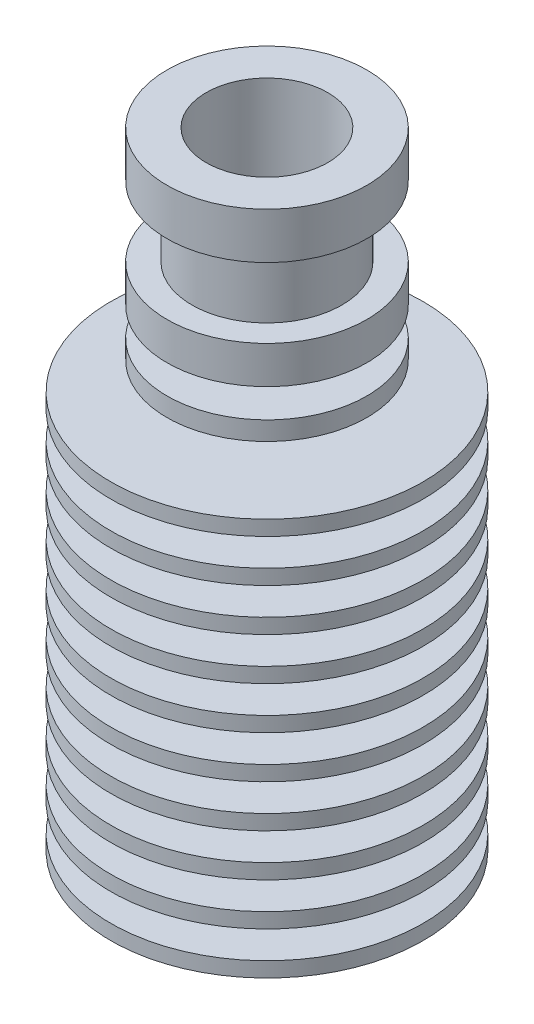
ISO-10303-21;
HEADER;
FILE_DESCRIPTION(('STEP AP214'),'2;1');
FILE_NAME('part.step','',(''),(''),'','','');
FILE_SCHEMA(('AUTOMOTIVE_DESIGN { 1 0 10303 214 1 1 1 1 }'));
ENDSEC;
DATA;
#1=APPLICATION_CONTEXT('core data for automotive mechanical design processes');
#2=APPLICATION_PROTOCOL_DEFINITION('international standard','automotive_design',2000,#1);
#3=PRODUCT_CONTEXT('',#1,'mechanical');
#4=PRODUCT('Part','Part','',(#3));
#5=PRODUCT_RELATED_PRODUCT_CATEGORY('part','',(#4));
#6=PRODUCT_DEFINITION_FORMATION('','',#4);
#7=PRODUCT_DEFINITION_CONTEXT('part definition',#1,'design');
#8=PRODUCT_DEFINITION('design','',#6,#7);
#9=PRODUCT_DEFINITION_SHAPE('','',#8);
#10=(LENGTH_UNIT() NAMED_UNIT(*) SI_UNIT(.MILLI.,.METRE.));
#11=(NAMED_UNIT(*) PLANE_ANGLE_UNIT() SI_UNIT($,.RADIAN.));
#12=(NAMED_UNIT(*) SI_UNIT($,.STERADIAN.) SOLID_ANGLE_UNIT());
#13=UNCERTAINTY_MEASURE_WITH_UNIT(LENGTH_MEASURE(1.E-05),#10,'distance_accuracy_value','');
#14=(GEOMETRIC_REPRESENTATION_CONTEXT(3) GLOBAL_UNCERTAINTY_ASSIGNED_CONTEXT((#13)) GLOBAL_UNIT_ASSIGNED_CONTEXT((#10,
#11,#12)) REPRESENTATION_CONTEXT('',''));
#15=CARTESIAN_POINT('',(0.,0.,0.));
#16=DIRECTION('',(0.,0.,1.));
#17=DIRECTION('',(1.,0.,0.));
#18=AXIS2_PLACEMENT_3D('',#15,#16,#17);
#19=CARTESIAN_POINT('',(0.,-25.05,0.));
#20=DIRECTION('',(0.,-1.,0.));
#21=DIRECTION('',(0.,0.,-1.));
#22=AXIS2_PLACEMENT_3D('',#19,#20,#21);
#23=CYLINDRICAL_SURFACE('',#22,3.);
#24=CARTESIAN_POINT('',(0.,-25.05,0.));
#25=DIRECTION('',(0.,-1.,0.));
#26=DIRECTION('',(0.,0.,-1.));
#27=AXIS2_PLACEMENT_3D('',#24,#25,#26);
#28=CIRCLE('',#27,3.);
#29=CARTESIAN_POINT('',(0.,-25.05,-3.));
#30=VERTEX_POINT('',#29);
#31=EDGE_CURVE('E208',#30,#30,#28,.T.);
#32=ORIENTED_EDGE('',*,*,#31,.T.);
#33=EDGE_LOOP('',(#32));
#34=FACE_BOUND('',#33,.T.);
#35=CARTESIAN_POINT('',(0.,-7.05,0.));
#36=DIRECTION('',(0.,-1.,0.));
#37=DIRECTION('',(0.,0.,-1.));
#38=AXIS2_PLACEMENT_3D('',#35,#36,#37);
#39=CIRCLE('',#38,3.);
#40=CARTESIAN_POINT('',(0.,-7.05,-3.));
#41=VERTEX_POINT('',#40);
#42=EDGE_CURVE('E10',#41,#41,#39,.T.);
#43=ORIENTED_EDGE('',*,*,#42,.F.);
#44=EDGE_LOOP('',(#43));
#45=FACE_BOUND('',#44,.T.);
#46=ADVANCED_FACE('F30',(#34,#45),#23,.F.);
#47=CARTESIAN_POINT('',(0.,-5.89529946162076,0.));
#48=DIRECTION('',(0.,-1.,0.));
#49=DIRECTION('',(0.,0.,-1.));
#50=AXIS2_PLACEMENT_3D('',#47,#48,#49);
#51=CONICAL_SURFACE('',#50,1.,1.0471975511966);
#52=ORIENTED_EDGE('',*,*,#42,.T.);
#53=EDGE_LOOP('',(#52));
#54=FACE_BOUND('',#53,.T.);
#55=CARTESIAN_POINT('',(0.,-5.89529946162076,0.));
#56=DIRECTION('',(0.,-1.,0.));
#57=DIRECTION('',(0.,0.,-1.));
#58=AXIS2_PLACEMENT_3D('',#55,#56,#57);
#59=CIRCLE('',#58,1.);
#60=CARTESIAN_POINT('',(0.,-5.89529946162076,-1.));
#61=VERTEX_POINT('',#60);
#62=EDGE_CURVE('E36',#61,#61,#59,.T.);
#63=ORIENTED_EDGE('',*,*,#62,.F.);
#64=EDGE_LOOP('',(#63));
#65=FACE_BOUND('',#64,.T.);
#66=ADVANCED_FACE('F226',(#54,#65),#51,.F.);
#67=CARTESIAN_POINT('',(0.,-25.05,0.));
#68=DIRECTION('',(0.,-1.,0.));
#69=DIRECTION('',(0.,0.,-1.));
#70=AXIS2_PLACEMENT_3D('',#67,#68,#69);
#71=CYLINDRICAL_SURFACE('',#70,1.);
#72=ORIENTED_EDGE('',*,*,#62,.T.);
#73=EDGE_LOOP('',(#72));
#74=FACE_BOUND('',#73,.T.);
#75=CARTESIAN_POINT('',(0.,5.51188301285237,0.));
#76=DIRECTION('',(0.,-1.,0.));
#77=DIRECTION('',(0.,0.,-1.));
#78=AXIS2_PLACEMENT_3D('',#75,#76,#77);
#79=CIRCLE('',#78,1.);
#80=CARTESIAN_POINT('',(0.,5.51188301285237,-1.));
#81=VERTEX_POINT('',#80);
#82=EDGE_CURVE('E40',#81,#81,#79,.T.);
#83=ORIENTED_EDGE('',*,*,#82,.F.);
#84=EDGE_LOOP('',(#83));
#85=FACE_BOUND('',#84,.T.);
#86=ADVANCED_FACE('F230',(#74,#85),#71,.F.);
#87=CARTESIAN_POINT('',(0.,6.08923328204199,0.));
#88=DIRECTION('',(0.,1.,0.));
#89=DIRECTION('',(0.,0.,1.));
#90=AXIS2_PLACEMENT_3D('',#87,#88,#89);
#91=CONICAL_SURFACE('',#90,2.,1.0471975511966);
#92=ORIENTED_EDGE('',*,*,#82,.T.);
#93=EDGE_LOOP('',(#92));
#94=FACE_BOUND('',#93,.T.);
#95=CARTESIAN_POINT('',(0.,6.08923328204199,0.));
#96=DIRECTION('',(0.,-1.,0.));
#97=DIRECTION('',(0.,0.,-1.));
#98=AXIS2_PLACEMENT_3D('',#95,#96,#97);
#99=CIRCLE('',#98,2.);
#100=CARTESIAN_POINT('',(0.,6.08923328204199,-2.));
#101=VERTEX_POINT('',#100);
#102=EDGE_CURVE('E44',#101,#101,#99,.T.);
#103=ORIENTED_EDGE('',*,*,#102,.F.);
#104=EDGE_LOOP('',(#103));
#105=FACE_BOUND('',#104,.T.);
#106=ADVANCED_FACE('F234',(#94,#105),#91,.F.);
#107=CARTESIAN_POINT('',(0.,-25.05,0.));
#108=DIRECTION('',(0.,-1.,0.));
#109=DIRECTION('',(0.,0.,-1.));
#110=AXIS2_PLACEMENT_3D('',#107,#108,#109);
#111=CYLINDRICAL_SURFACE('',#110,2.);
#112=ORIENTED_EDGE('',*,*,#102,.T.);
#113=EDGE_LOOP('',(#112));
#114=FACE_BOUND('',#113,.T.);
#115=CARTESIAN_POINT('',(0.,10.089233282042,0.));
#116=DIRECTION('',(0.,-1.,0.));
#117=DIRECTION('',(0.,0.,-1.));
#118=AXIS2_PLACEMENT_3D('',#115,#116,#117);
#119=CIRCLE('',#118,2.);
#120=CARTESIAN_POINT('',(0.,10.089233282042,-2.));
#121=VERTEX_POINT('',#120);
#122=EDGE_CURVE('E49',#121,#121,#119,.T.);
#123=ORIENTED_EDGE('',*,*,#122,.F.);
#124=EDGE_LOOP('',(#123));
#125=FACE_BOUND('',#124,.T.);
#126=ADVANCED_FACE('F240',(#114,#125),#111,.F.);
#127=CARTESIAN_POINT('',(0.,15.05,0.));
#128=DIRECTION('',(0.,1.,0.));
#129=DIRECTION('',(0.,0.,1.));
#130=AXIS2_PLACEMENT_3D('',#127,#128,#129);
#131=CONICAL_SURFACE('',#130,4.8641,0.5235987755983);
#132=ORIENTED_EDGE('',*,*,#122,.T.);
#133=EDGE_LOOP('',(#132));
#134=FACE_BOUND('',#133,.T.);
#135=CARTESIAN_POINT('',(0.,15.05,0.));
#136=DIRECTION('',(0.,-1.,0.));
#137=DIRECTION('',(0.,0.,-1.));
#138=AXIS2_PLACEMENT_3D('',#135,#136,#137);
#139=CIRCLE('',#138,4.8641);
#140=CARTESIAN_POINT('',(0.,15.05,-4.8641));
#141=VERTEX_POINT('',#140);
#142=EDGE_CURVE('E52',#141,#141,#139,.T.);
#143=ORIENTED_EDGE('',*,*,#142,.F.);
#144=EDGE_LOOP('',(#143));
#145=FACE_BOUND('',#144,.T.);
#146=ADVANCED_FACE('F244',(#134,#145),#131,.F.);
#147=CARTESIAN_POINT('',(0.,-25.05,0.));
#148=DIRECTION('',(0.,-1.,0.));
#149=DIRECTION('',(0.,0.,-1.));
#150=AXIS2_PLACEMENT_3D('',#147,#148,#149);
#151=CYLINDRICAL_SURFACE('',#150,4.8641);
#152=ORIENTED_EDGE('',*,*,#142,.T.);
#153=EDGE_LOOP('',(#152));
#154=FACE_BOUND('',#153,.T.);
#155=CARTESIAN_POINT('',(0.,25.05,0.));
#156=DIRECTION('',(0.,-1.,0.));
#157=DIRECTION('',(0.,0.,-1.));
#158=AXIS2_PLACEMENT_3D('',#155,#156,#157);
#159=CIRCLE('',#158,4.8641);
#160=CARTESIAN_POINT('',(0.,25.05,-4.8641));
#161=VERTEX_POINT('',#160);
#162=EDGE_CURVE('E55',#161,#161,#159,.T.);
#163=ORIENTED_EDGE('',*,*,#162,.F.);
#164=EDGE_LOOP('',(#163));
#165=FACE_BOUND('',#164,.T.);
#166=ADVANCED_FACE('F248',(#154,#165),#151,.F.);
#167=CARTESIAN_POINT('',(4.8641,25.05,0.));
#168=DIRECTION('',(0.,1.,0.));
#169=DIRECTION('',(0.,0.,1.));
#170=AXIS2_PLACEMENT_3D('',#167,#168,#169);
#171=PLANE('',#170);
#172=ORIENTED_EDGE('',*,*,#162,.T.);
#173=EDGE_LOOP('',(#172));
#174=FACE_BOUND('',#173,.T.);
#175=CARTESIAN_POINT('',(0.,25.05,0.));
#176=DIRECTION('',(0.,-1.,0.));
#177=DIRECTION('',(0.,0.,-1.));
#178=AXIS2_PLACEMENT_3D('',#175,#176,#177);
#179=CIRCLE('',#178,8.);
#180=CARTESIAN_POINT('',(0.,25.05,-8.));
#181=VERTEX_POINT('',#180);
#182=EDGE_CURVE('E58',#181,#181,#179,.T.);
#183=ORIENTED_EDGE('',*,*,#182,.F.);
#184=EDGE_LOOP('',(#183));
#185=FACE_BOUND('',#184,.T.);
#186=ADVANCED_FACE('F252',(#174,#185),#171,.T.);
#187=CARTESIAN_POINT('',(0.,-25.05,0.));
#188=DIRECTION('',(0.,-1.,0.));
#189=DIRECTION('',(0.,0.,-1.));
#190=AXIS2_PLACEMENT_3D('',#187,#188,#189);
#191=CYLINDRICAL_SURFACE('',#190,8.);
#192=ORIENTED_EDGE('',*,*,#182,.T.);
#193=EDGE_LOOP('',(#192));
#194=FACE_BOUND('',#193,.T.);
#195=CARTESIAN_POINT('',(0.,21.35,0.));
#196=DIRECTION('',(0.,-1.,0.));
#197=DIRECTION('',(0.,0.,-1.));
#198=AXIS2_PLACEMENT_3D('',#195,#196,#197);
#199=CIRCLE('',#198,8.);
#200=CARTESIAN_POINT('',(0.,21.35,-8.));
#201=VERTEX_POINT('',#200);
#202=EDGE_CURVE('E61',#201,#201,#199,.T.);
#203=ORIENTED_EDGE('',*,*,#202,.F.);
#204=EDGE_LOOP('',(#203));
#205=FACE_BOUND('',#204,.T.);
#206=ADVANCED_FACE('F256',(#194,#205),#191,.T.);
#207=CARTESIAN_POINT('',(6.,21.35,0.));
#208=DIRECTION('',(0.,-1.,0.));
#209=DIRECTION('',(0.,0.,-1.));
#210=AXIS2_PLACEMENT_3D('',#207,#208,#209);
#211=PLANE('',#210);
#212=ORIENTED_EDGE('',*,*,#202,.T.);
#213=EDGE_LOOP('',(#212));
#214=FACE_BOUND('',#213,.T.);
#215=CARTESIAN_POINT('',(0.,21.35,0.));
#216=DIRECTION('',(0.,-1.,0.));
#217=DIRECTION('',(0.,0.,-1.));
#218=AXIS2_PLACEMENT_3D('',#215,#216,#217);
#219=CIRCLE('',#218,6.);
#220=CARTESIAN_POINT('',(0.,21.35,-6.));
#221=VERTEX_POINT('',#220);
#222=EDGE_CURVE('E64',#221,#221,#219,.T.);
#223=ORIENTED_EDGE('',*,*,#222,.F.);
#224=EDGE_LOOP('',(#223));
#225=FACE_BOUND('',#224,.T.);
#226=ADVANCED_FACE('F260',(#214,#225),#211,.T.);
#227=CARTESIAN_POINT('',(0.,-25.05,0.));
#228=DIRECTION('',(0.,-1.,0.));
#229=DIRECTION('',(0.,0.,-1.));
#230=AXIS2_PLACEMENT_3D('',#227,#228,#229);
#231=CYLINDRICAL_SURFACE('',#230,6.);
#232=ORIENTED_EDGE('',*,*,#222,.T.);
#233=EDGE_LOOP('',(#232));
#234=FACE_BOUND('',#233,.T.);
#235=CARTESIAN_POINT('',(0.,15.75,0.));
#236=DIRECTION('',(0.,-1.,0.));
#237=DIRECTION('',(0.,0.,-1.));
#238=AXIS2_PLACEMENT_3D('',#235,#236,#237);
#239=CIRCLE('',#238,6.);
#240=CARTESIAN_POINT('',(0.,15.75,-6.));
#241=VERTEX_POINT('',#240);
#242=EDGE_CURVE('E67',#241,#241,#239,.T.);
#243=ORIENTED_EDGE('',*,*,#242,.F.);
#244=EDGE_LOOP('',(#243));
#245=FACE_BOUND('',#244,.T.);
#246=ADVANCED_FACE('F264',(#234,#245),#231,.T.);
#247=CARTESIAN_POINT('',(8.,15.75,0.));
#248=DIRECTION('',(0.,1.,0.));
#249=DIRECTION('',(0.,0.,1.));
#250=AXIS2_PLACEMENT_3D('',#247,#248,#249);
#251=PLANE('',#250);
#252=ORIENTED_EDGE('',*,*,#242,.T.);
#253=EDGE_LOOP('',(#252));
#254=FACE_BOUND('',#253,.T.);
#255=CARTESIAN_POINT('',(0.,15.75,0.));
#256=DIRECTION('',(0.,-1.,0.));
#257=DIRECTION('',(0.,0.,-1.));
#258=AXIS2_PLACEMENT_3D('',#255,#256,#257);
#259=CIRCLE('',#258,8.);
#260=CARTESIAN_POINT('',(0.,15.75,-8.));
#261=VERTEX_POINT('',#260);
#262=EDGE_CURVE('E70',#261,#261,#259,.T.);
#263=ORIENTED_EDGE('',*,*,#262,.F.);
#264=EDGE_LOOP('',(#263));
#265=FACE_BOUND('',#264,.T.);
#266=ADVANCED_FACE('F268',(#254,#265),#251,.T.);
#267=CARTESIAN_POINT('',(0.,-25.05,0.));
#268=DIRECTION('',(0.,-1.,0.));
#269=DIRECTION('',(0.,0.,-1.));
#270=AXIS2_PLACEMENT_3D('',#267,#268,#269);
#271=CYLINDRICAL_SURFACE('',#270,8.);
#272=ORIENTED_EDGE('',*,*,#262,.T.);
#273=EDGE_LOOP('',(#272));
#274=FACE_BOUND('',#273,.T.);
#275=CARTESIAN_POINT('',(0.,12.75,0.));
#276=DIRECTION('',(0.,-1.,0.));
#277=DIRECTION('',(0.,0.,-1.));
#278=AXIS2_PLACEMENT_3D('',#275,#276,#277);
#279=CIRCLE('',#278,8.);
#280=CARTESIAN_POINT('',(0.,12.75,-8.));
#281=VERTEX_POINT('',#280);
#282=EDGE_CURVE('E73',#281,#281,#279,.T.);
#283=ORIENTED_EDGE('',*,*,#282,.F.);
#284=EDGE_LOOP('',(#283));
#285=FACE_BOUND('',#284,.T.);
#286=ADVANCED_FACE('F272',(#274,#285),#271,.T.);
#287=CARTESIAN_POINT('',(4.5,12.75,0.));
#288=DIRECTION('',(0.,-1.,0.));
#289=DIRECTION('',(0.,0.,-1.));
#290=AXIS2_PLACEMENT_3D('',#287,#288,#289);
#291=PLANE('',#290);
#292=ORIENTED_EDGE('',*,*,#282,.T.);
#293=EDGE_LOOP('',(#292));
#294=FACE_BOUND('',#293,.T.);
#295=CARTESIAN_POINT('',(0.,12.75,0.));
#296=DIRECTION('',(0.,-1.,0.));
#297=DIRECTION('',(0.,0.,-1.));
#298=AXIS2_PLACEMENT_3D('',#295,#296,#297);
#299=CIRCLE('',#298,4.5);
#300=CARTESIAN_POINT('',(0.,12.75,-4.5));
#301=VERTEX_POINT('',#300);
#302=EDGE_CURVE('E76',#301,#301,#299,.T.);
#303=ORIENTED_EDGE('',*,*,#302,.F.);
#304=EDGE_LOOP('',(#303));
#305=FACE_BOUND('',#304,.T.);
#306=ADVANCED_FACE('F276',(#294,#305),#291,.T.);
#307=CARTESIAN_POINT('',(0.,-25.05,0.));
#308=DIRECTION('',(0.,-1.,0.));
#309=DIRECTION('',(0.,0.,-1.));
#310=AXIS2_PLACEMENT_3D('',#307,#308,#309);
#311=CYLINDRICAL_SURFACE('',#310,4.5);
#312=ORIENTED_EDGE('',*,*,#302,.T.);
#313=EDGE_LOOP('',(#312));
#314=FACE_BOUND('',#313,.T.);
#315=CARTESIAN_POINT('',(0.,10.45,0.));
#316=DIRECTION('',(0.,-1.,0.));
#317=DIRECTION('',(0.,0.,-1.));
#318=AXIS2_PLACEMENT_3D('',#315,#316,#317);
#319=CIRCLE('',#318,4.5);
#320=CARTESIAN_POINT('',(0.,10.45,-4.5));
#321=VERTEX_POINT('',#320);
#322=EDGE_CURVE('E79',#321,#321,#319,.T.);
#323=ORIENTED_EDGE('',*,*,#322,.F.);
#324=EDGE_LOOP('',(#323));
#325=FACE_BOUND('',#324,.T.);
#326=ADVANCED_FACE('F280',(#314,#325),#311,.T.);
#327=CARTESIAN_POINT('',(8.,10.45,0.));
#328=DIRECTION('',(0.,1.,0.));
#329=DIRECTION('',(0.,0.,1.));
#330=AXIS2_PLACEMENT_3D('',#327,#328,#329);
#331=PLANE('',#330);
#332=ORIENTED_EDGE('',*,*,#322,.T.);
#333=EDGE_LOOP('',(#332));
#334=FACE_BOUND('',#333,.T.);
#335=CARTESIAN_POINT('',(0.,10.45,0.));
#336=DIRECTION('',(0.,-1.,0.));
#337=DIRECTION('',(0.,0.,-1.));
#338=AXIS2_PLACEMENT_3D('',#335,#336,#337);
#339=CIRCLE('',#338,8.);
#340=CARTESIAN_POINT('',(0.,10.45,-8.));
#341=VERTEX_POINT('',#340);
#342=EDGE_CURVE('E82',#341,#341,#339,.T.);
#343=ORIENTED_EDGE('',*,*,#342,.F.);
#344=EDGE_LOOP('',(#343));
#345=FACE_BOUND('',#344,.T.);
#346=ADVANCED_FACE('F284',(#334,#345),#331,.T.);
#347=CARTESIAN_POINT('',(0.,-25.05,0.));
#348=DIRECTION('',(0.,-1.,0.));
#349=DIRECTION('',(0.,0.,-1.));
#350=AXIS2_PLACEMENT_3D('',#347,#348,#349);
#351=CYLINDRICAL_SURFACE('',#350,8.);
#352=ORIENTED_EDGE('',*,*,#342,.T.);
#353=EDGE_LOOP('',(#352));
#354=FACE_BOUND('',#353,.T.);
#355=CARTESIAN_POINT('',(0.,8.95,0.));
#356=DIRECTION('',(0.,-1.,0.));
#357=DIRECTION('',(0.,0.,-1.));
#358=AXIS2_PLACEMENT_3D('',#355,#356,#357);
#359=CIRCLE('',#358,8.);
#360=CARTESIAN_POINT('',(0.,8.95,-8.));
#361=VERTEX_POINT('',#360);
#362=EDGE_CURVE('E85',#361,#361,#359,.T.);
#363=ORIENTED_EDGE('',*,*,#362,.F.);
#364=EDGE_LOOP('',(#363));
#365=FACE_BOUND('',#364,.T.);
#366=ADVANCED_FACE('F288',(#354,#365),#351,.T.);
#367=CARTESIAN_POINT('',(4.5,8.95,0.));
#368=DIRECTION('',(0.,-1.,0.));
#369=DIRECTION('',(0.,0.,-1.));
#370=AXIS2_PLACEMENT_3D('',#367,#368,#369);
#371=PLANE('',#370);
#372=ORIENTED_EDGE('',*,*,#362,.T.);
#373=EDGE_LOOP('',(#372));
#374=FACE_BOUND('',#373,.T.);
#375=CARTESIAN_POINT('',(0.,8.95,0.));
#376=DIRECTION('',(0.,-1.,0.));
#377=DIRECTION('',(0.,0.,-1.));
#378=AXIS2_PLACEMENT_3D('',#375,#376,#377);
#379=CIRCLE('',#378,4.5);
#380=CARTESIAN_POINT('',(0.,8.95,-4.5));
#381=VERTEX_POINT('',#380);
#382=EDGE_CURVE('E88',#381,#381,#379,.T.);
#383=ORIENTED_EDGE('',*,*,#382,.F.);
#384=EDGE_LOOP('',(#383));
#385=FACE_BOUND('',#384,.T.);
#386=ADVANCED_FACE('F292',(#374,#385),#371,.T.);
#387=CARTESIAN_POINT('',(0.,-25.05,0.));
#388=DIRECTION('',(0.,-1.,0.));
#389=DIRECTION('',(0.,0.,-1.));
#390=AXIS2_PLACEMENT_3D('',#387,#388,#389);
#391=CYLINDRICAL_SURFACE('',#390,4.5);
#392=ORIENTED_EDGE('',*,*,#382,.T.);
#393=EDGE_LOOP('',(#392));
#394=FACE_BOUND('',#393,.T.);
#395=CARTESIAN_POINT('',(0.,6.75,0.));
#396=DIRECTION('',(0.,-1.,0.));
#397=DIRECTION('',(0.,0.,-1.));
#398=AXIS2_PLACEMENT_3D('',#395,#396,#397);
#399=CIRCLE('',#398,4.5);
#400=CARTESIAN_POINT('',(0.,6.75,-4.5));
#401=VERTEX_POINT('',#400);
#402=EDGE_CURVE('E91',#401,#401,#399,.T.);
#403=ORIENTED_EDGE('',*,*,#402,.F.);
#404=EDGE_LOOP('',(#403));
#405=FACE_BOUND('',#404,.T.);
#406=ADVANCED_FACE('F296',(#394,#405),#391,.T.);
#407=CARTESIAN_POINT('',(12.5,6.75,0.));
#408=DIRECTION('',(0.,1.,0.));
#409=DIRECTION('',(0.,0.,1.));
#410=AXIS2_PLACEMENT_3D('',#407,#408,#409);
#411=PLANE('',#410);
#412=ORIENTED_EDGE('',*,*,#402,.T.);
#413=EDGE_LOOP('',(#412));
#414=FACE_BOUND('',#413,.T.);
#415=CARTESIAN_POINT('',(0.,6.75,0.));
#416=DIRECTION('',(0.,-1.,0.));
#417=DIRECTION('',(0.,0.,-1.));
#418=AXIS2_PLACEMENT_3D('',#415,#416,#417);
#419=CIRCLE('',#418,12.5);
#420=CARTESIAN_POINT('',(0.,6.75,-12.5));
#421=VERTEX_POINT('',#420);
#422=EDGE_CURVE('E94',#421,#421,#419,.T.);
#423=ORIENTED_EDGE('',*,*,#422,.F.);
#424=EDGE_LOOP('',(#423));
#425=FACE_BOUND('',#424,.T.);
#426=ADVANCED_FACE('F300',(#414,#425),#411,.T.);
#427=CARTESIAN_POINT('',(0.,-25.05,0.));
#428=DIRECTION('',(0.,-1.,0.));
#429=DIRECTION('',(0.,0.,-1.));
#430=AXIS2_PLACEMENT_3D('',#427,#428,#429);
#431=CYLINDRICAL_SURFACE('',#430,12.5);
#432=ORIENTED_EDGE('',*,*,#422,.T.);
#433=EDGE_LOOP('',(#432));
#434=FACE_BOUND('',#433,.T.);
#435=CARTESIAN_POINT('',(0.,5.55,0.));
#436=DIRECTION('',(0.,-1.,0.));
#437=DIRECTION('',(0.,0.,-1.));
#438=AXIS2_PLACEMENT_3D('',#435,#436,#437);
#439=CIRCLE('',#438,12.5);
#440=CARTESIAN_POINT('',(0.,5.55,-12.5));
#441=VERTEX_POINT('',#440);
#442=EDGE_CURVE('E97',#441,#441,#439,.T.);
#443=ORIENTED_EDGE('',*,*,#442,.F.);
#444=EDGE_LOOP('',(#443));
#445=FACE_BOUND('',#444,.T.);
#446=ADVANCED_FACE('F304',(#434,#445),#431,.T.);
#447=CARTESIAN_POINT('',(4.5,5.55,0.));
#448=DIRECTION('',(0.,-1.,0.));
#449=DIRECTION('',(0.,0.,-1.));
#450=AXIS2_PLACEMENT_3D('',#447,#448,#449);
#451=PLANE('',#450);
#452=ORIENTED_EDGE('',*,*,#442,.T.);
#453=EDGE_LOOP('',(#452));
#454=FACE_BOUND('',#453,.T.);
#455=CARTESIAN_POINT('',(0.,5.55,0.));
#456=DIRECTION('',(0.,-1.,0.));
#457=DIRECTION('',(0.,0.,-1.));
#458=AXIS2_PLACEMENT_3D('',#455,#456,#457);
#459=CIRCLE('',#458,4.5);
#460=CARTESIAN_POINT('',(0.,5.55,-4.5));
#461=VERTEX_POINT('',#460);
#462=EDGE_CURVE('E100',#461,#461,#459,.T.);
#463=ORIENTED_EDGE('',*,*,#462,.F.);
#464=EDGE_LOOP('',(#463));
#465=FACE_BOUND('',#464,.T.);
#466=ADVANCED_FACE('F308',(#454,#465),#451,.T.);
#467=CARTESIAN_POINT('',(0.,-25.05,0.));
#468=DIRECTION('',(0.,-1.,0.));
#469=DIRECTION('',(0.,0.,-1.));
#470=AXIS2_PLACEMENT_3D('',#467,#468,#469);
#471=CYLINDRICAL_SURFACE('',#470,4.5);
#472=ORIENTED_EDGE('',*,*,#462,.T.);
#473=EDGE_LOOP('',(#472));
#474=FACE_BOUND('',#473,.T.);
#475=CARTESIAN_POINT('',(0.,3.35,0.));
#476=DIRECTION('',(0.,-1.,0.));
#477=DIRECTION('',(0.,0.,-1.));
#478=AXIS2_PLACEMENT_3D('',#475,#476,#477);
#479=CIRCLE('',#478,4.5);
#480=CARTESIAN_POINT('',(0.,3.35,-4.5));
#481=VERTEX_POINT('',#480);
#482=EDGE_CURVE('E103',#481,#481,#479,.T.);
#483=ORIENTED_EDGE('',*,*,#482,.F.);
#484=EDGE_LOOP('',(#483));
#485=FACE_BOUND('',#484,.T.);
#486=ADVANCED_FACE('F312',(#474,#485),#471,.T.);
#487=CARTESIAN_POINT('',(12.5,3.35,0.));
#488=DIRECTION('',(0.,1.,0.));
#489=DIRECTION('',(0.,0.,1.));
#490=AXIS2_PLACEMENT_3D('',#487,#488,#489);
#491=PLANE('',#490);
#492=ORIENTED_EDGE('',*,*,#482,.T.);
#493=EDGE_LOOP('',(#492));
#494=FACE_BOUND('',#493,.T.);
#495=CARTESIAN_POINT('',(0.,3.35,0.));
#496=DIRECTION('',(0.,-1.,0.));
#497=DIRECTION('',(0.,0.,-1.));
#498=AXIS2_PLACEMENT_3D('',#495,#496,#497);
#499=CIRCLE('',#498,12.5);
#500=CARTESIAN_POINT('',(0.,3.35,-12.5));
#501=VERTEX_POINT('',#500);
#502=EDGE_CURVE('E106',#501,#501,#499,.T.);
#503=ORIENTED_EDGE('',*,*,#502,.F.);
#504=EDGE_LOOP('',(#503));
#505=FACE_BOUND('',#504,.T.);
#506=ADVANCED_FACE('F316',(#494,#505),#491,.T.);
#507=CARTESIAN_POINT('',(0.,-25.05,0.));
#508=DIRECTION('',(0.,-1.,0.));
#509=DIRECTION('',(0.,0.,-1.));
#510=AXIS2_PLACEMENT_3D('',#507,#508,#509);
#511=CYLINDRICAL_SURFACE('',#510,12.5);
#512=ORIENTED_EDGE('',*,*,#502,.T.);
#513=EDGE_LOOP('',(#512));
#514=FACE_BOUND('',#513,.T.);
#515=CARTESIAN_POINT('',(0.,2.15,0.));
#516=DIRECTION('',(0.,-1.,0.));
#517=DIRECTION('',(0.,0.,-1.));
#518=AXIS2_PLACEMENT_3D('',#515,#516,#517);
#519=CIRCLE('',#518,12.5);
#520=CARTESIAN_POINT('',(0.,2.15,-12.5));
#521=VERTEX_POINT('',#520);
#522=EDGE_CURVE('E109',#521,#521,#519,.T.);
#523=ORIENTED_EDGE('',*,*,#522,.F.);
#524=EDGE_LOOP('',(#523));
#525=FACE_BOUND('',#524,.T.);
#526=ADVANCED_FACE('F320',(#514,#525),#511,.T.);
#527=CARTESIAN_POINT('',(4.5,2.15,0.));
#528=DIRECTION('',(0.,-1.,0.));
#529=DIRECTION('',(0.,0.,-1.));
#530=AXIS2_PLACEMENT_3D('',#527,#528,#529);
#531=PLANE('',#530);
#532=ORIENTED_EDGE('',*,*,#522,.T.);
#533=EDGE_LOOP('',(#532));
#534=FACE_BOUND('',#533,.T.);
#535=CARTESIAN_POINT('',(0.,2.15,0.));
#536=DIRECTION('',(0.,-1.,0.));
#537=DIRECTION('',(0.,0.,-1.));
#538=AXIS2_PLACEMENT_3D('',#535,#536,#537);
#539=CIRCLE('',#538,4.5);
#540=CARTESIAN_POINT('',(0.,2.15,-4.5));
#541=VERTEX_POINT('',#540);
#542=EDGE_CURVE('E112',#541,#541,#539,.T.);
#543=ORIENTED_EDGE('',*,*,#542,.F.);
#544=EDGE_LOOP('',(#543));
#545=FACE_BOUND('',#544,.T.);
#546=ADVANCED_FACE('F324',(#534,#545),#531,.T.);
#547=CARTESIAN_POINT('',(0.,-25.05,0.));
#548=DIRECTION('',(0.,-1.,0.));
#549=DIRECTION('',(0.,0.,-1.));
#550=AXIS2_PLACEMENT_3D('',#547,#548,#549);
#551=CYLINDRICAL_SURFACE('',#550,4.5);
#552=ORIENTED_EDGE('',*,*,#542,.T.);
#553=EDGE_LOOP('',(#552));
#554=FACE_BOUND('',#553,.T.);
#555=CARTESIAN_POINT('',(0.,-0.0500000000000014,0.));
#556=DIRECTION('',(0.,-1.,0.));
#557=DIRECTION('',(0.,0.,-1.));
#558=AXIS2_PLACEMENT_3D('',#555,#556,#557);
#559=CIRCLE('',#558,4.5);
#560=CARTESIAN_POINT('',(0.,-0.0500000000000014,-4.5));
#561=VERTEX_POINT('',#560);
#562=EDGE_CURVE('E115',#561,#561,#559,.T.);
#563=ORIENTED_EDGE('',*,*,#562,.F.);
#564=EDGE_LOOP('',(#563));
#565=FACE_BOUND('',#564,.T.);
#566=ADVANCED_FACE('F328',(#554,#565),#551,.T.);
#567=CARTESIAN_POINT('',(12.5,-0.0500000000000002,0.));
#568=DIRECTION('',(0.,1.,0.));
#569=DIRECTION('',(0.,0.,1.));
#570=AXIS2_PLACEMENT_3D('',#567,#568,#569);
#571=PLANE('',#570);
#572=ORIENTED_EDGE('',*,*,#562,.T.);
#573=EDGE_LOOP('',(#572));
#574=FACE_BOUND('',#573,.T.);
#575=CARTESIAN_POINT('',(0.,-0.049999999999998,0.));
#576=DIRECTION('',(0.,-1.,0.));
#577=DIRECTION('',(0.,0.,-1.));
#578=AXIS2_PLACEMENT_3D('',#575,#576,#577);
#579=CIRCLE('',#578,12.5);
#580=CARTESIAN_POINT('',(0.,-0.049999999999998,-12.5));
#581=VERTEX_POINT('',#580);
#582=EDGE_CURVE('E118',#581,#581,#579,.T.);
#583=ORIENTED_EDGE('',*,*,#582,.F.);
#584=EDGE_LOOP('',(#583));
#585=FACE_BOUND('',#584,.T.);
#586=ADVANCED_FACE('F332',(#574,#585),#571,.T.);
#587=CARTESIAN_POINT('',(0.,-25.05,0.));
#588=DIRECTION('',(0.,-1.,0.));
#589=DIRECTION('',(0.,0.,-1.));
#590=AXIS2_PLACEMENT_3D('',#587,#588,#589);
#591=CYLINDRICAL_SURFACE('',#590,12.5);
#592=ORIENTED_EDGE('',*,*,#582,.T.);
#593=EDGE_LOOP('',(#592));
#594=FACE_BOUND('',#593,.T.);
#595=CARTESIAN_POINT('',(0.,-1.25,0.));
#596=DIRECTION('',(0.,-1.,0.));
#597=DIRECTION('',(0.,0.,-1.));
#598=AXIS2_PLACEMENT_3D('',#595,#596,#597);
#599=CIRCLE('',#598,12.5);
#600=CARTESIAN_POINT('',(0.,-1.25,-12.5));
#601=VERTEX_POINT('',#600);
#602=EDGE_CURVE('E121',#601,#601,#599,.T.);
#603=ORIENTED_EDGE('',*,*,#602,.F.);
#604=EDGE_LOOP('',(#603));
#605=FACE_BOUND('',#604,.T.);
#606=ADVANCED_FACE('F336',(#594,#605),#591,.T.);
#607=CARTESIAN_POINT('',(4.5,-1.25,0.));
#608=DIRECTION('',(0.,-1.,0.));
#609=DIRECTION('',(0.,0.,-1.));
#610=AXIS2_PLACEMENT_3D('',#607,#608,#609);
#611=PLANE('',#610);
#612=ORIENTED_EDGE('',*,*,#602,.T.);
#613=EDGE_LOOP('',(#612));
#614=FACE_BOUND('',#613,.T.);
#615=CARTESIAN_POINT('',(0.,-1.25,0.));
#616=DIRECTION('',(0.,-1.,0.));
#617=DIRECTION('',(0.,0.,-1.));
#618=AXIS2_PLACEMENT_3D('',#615,#616,#617);
#619=CIRCLE('',#618,4.5);
#620=CARTESIAN_POINT('',(0.,-1.25,-4.5));
#621=VERTEX_POINT('',#620);
#622=EDGE_CURVE('E124',#621,#621,#619,.T.);
#623=ORIENTED_EDGE('',*,*,#622,.F.);
#624=EDGE_LOOP('',(#623));
#625=FACE_BOUND('',#624,.T.);
#626=ADVANCED_FACE('F340',(#614,#625),#611,.T.);
#627=CARTESIAN_POINT('',(0.,-25.05,0.));
#628=DIRECTION('',(0.,-1.,0.));
#629=DIRECTION('',(0.,0.,-1.));
#630=AXIS2_PLACEMENT_3D('',#627,#628,#629);
#631=CYLINDRICAL_SURFACE('',#630,4.5);
#632=ORIENTED_EDGE('',*,*,#622,.T.);
#633=EDGE_LOOP('',(#632));
#634=FACE_BOUND('',#633,.T.);
#635=CARTESIAN_POINT('',(0.,-3.45,0.));
#636=DIRECTION('',(0.,-1.,0.));
#637=DIRECTION('',(0.,0.,-1.));
#638=AXIS2_PLACEMENT_3D('',#635,#636,#637);
#639=CIRCLE('',#638,4.5);
#640=CARTESIAN_POINT('',(0.,-3.45,-4.5));
#641=VERTEX_POINT('',#640);
#642=EDGE_CURVE('E127',#641,#641,#639,.T.);
#643=ORIENTED_EDGE('',*,*,#642,.F.);
#644=EDGE_LOOP('',(#643));
#645=FACE_BOUND('',#644,.T.);
#646=ADVANCED_FACE('F344',(#634,#645),#631,.T.);
#647=CARTESIAN_POINT('',(12.5,-3.45,0.));
#648=DIRECTION('',(0.,1.,0.));
#649=DIRECTION('',(0.,0.,1.));
#650=AXIS2_PLACEMENT_3D('',#647,#648,#649);
#651=PLANE('',#650);
#652=ORIENTED_EDGE('',*,*,#642,.T.);
#653=EDGE_LOOP('',(#652));
#654=FACE_BOUND('',#653,.T.);
#655=CARTESIAN_POINT('',(0.,-3.45,0.));
#656=DIRECTION('',(0.,-1.,0.));
#657=DIRECTION('',(0.,0.,-1.));
#658=AXIS2_PLACEMENT_3D('',#655,#656,#657);
#659=CIRCLE('',#658,12.5);
#660=CARTESIAN_POINT('',(0.,-3.45,-12.5));
#661=VERTEX_POINT('',#660);
#662=EDGE_CURVE('E130',#661,#661,#659,.T.);
#663=ORIENTED_EDGE('',*,*,#662,.F.);
#664=EDGE_LOOP('',(#663));
#665=FACE_BOUND('',#664,.T.);
#666=ADVANCED_FACE('F348',(#654,#665),#651,.T.);
#667=CARTESIAN_POINT('',(0.,-25.05,0.));
#668=DIRECTION('',(0.,-1.,0.));
#669=DIRECTION('',(0.,0.,-1.));
#670=AXIS2_PLACEMENT_3D('',#667,#668,#669);
#671=CYLINDRICAL_SURFACE('',#670,12.5);
#672=ORIENTED_EDGE('',*,*,#662,.T.);
#673=EDGE_LOOP('',(#672));
#674=FACE_BOUND('',#673,.T.);
#675=CARTESIAN_POINT('',(0.,-4.65,0.));
#676=DIRECTION('',(0.,-1.,0.));
#677=DIRECTION('',(0.,0.,-1.));
#678=AXIS2_PLACEMENT_3D('',#675,#676,#677);
#679=CIRCLE('',#678,12.5);
#680=CARTESIAN_POINT('',(0.,-4.65,-12.5));
#681=VERTEX_POINT('',#680);
#682=EDGE_CURVE('E133',#681,#681,#679,.T.);
#683=ORIENTED_EDGE('',*,*,#682,.F.);
#684=EDGE_LOOP('',(#683));
#685=FACE_BOUND('',#684,.T.);
#686=ADVANCED_FACE('F352',(#674,#685),#671,.T.);
#687=CARTESIAN_POINT('',(6.5,-4.65,0.));
#688=DIRECTION('',(0.,-1.,0.));
#689=DIRECTION('',(0.,0.,-1.));
#690=AXIS2_PLACEMENT_3D('',#687,#688,#689);
#691=PLANE('',#690);
#692=ORIENTED_EDGE('',*,*,#682,.T.);
#693=EDGE_LOOP('',(#692));
#694=FACE_BOUND('',#693,.T.);
#695=CARTESIAN_POINT('',(0.,-4.65,0.));
#696=DIRECTION('',(0.,-1.,0.));
#697=DIRECTION('',(0.,0.,-1.));
#698=AXIS2_PLACEMENT_3D('',#695,#696,#697);
#699=CIRCLE('',#698,6.5);
#700=CARTESIAN_POINT('',(0.,-4.65,-6.5));
#701=VERTEX_POINT('',#700);
#702=EDGE_CURVE('E136',#701,#701,#699,.T.);
#703=ORIENTED_EDGE('',*,*,#702,.F.);
#704=EDGE_LOOP('',(#703));
#705=FACE_BOUND('',#704,.T.);
#706=ADVANCED_FACE('F356',(#694,#705),#691,.T.);
#707=CARTESIAN_POINT('',(0.,-25.05,0.));
#708=DIRECTION('',(0.,-1.,0.));
#709=DIRECTION('',(0.,0.,-1.));
#710=AXIS2_PLACEMENT_3D('',#707,#708,#709);
#711=CYLINDRICAL_SURFACE('',#710,6.5);
#712=ORIENTED_EDGE('',*,*,#702,.T.);
#713=EDGE_LOOP('',(#712));
#714=FACE_BOUND('',#713,.T.);
#715=CARTESIAN_POINT('',(0.,-6.85,0.));
#716=DIRECTION('',(0.,-1.,0.));
#717=DIRECTION('',(0.,0.,-1.));
#718=AXIS2_PLACEMENT_3D('',#715,#716,#717);
#719=CIRCLE('',#718,6.5);
#720=CARTESIAN_POINT('',(0.,-6.85,-6.5));
#721=VERTEX_POINT('',#720);
#722=EDGE_CURVE('E139',#721,#721,#719,.T.);
#723=ORIENTED_EDGE('',*,*,#722,.F.);
#724=EDGE_LOOP('',(#723));
#725=FACE_BOUND('',#724,.T.);
#726=ADVANCED_FACE('F360',(#714,#725),#711,.T.);
#727=CARTESIAN_POINT('',(12.5,-6.85,0.));
#728=DIRECTION('',(0.,1.,0.));
#729=DIRECTION('',(0.,0.,1.));
#730=AXIS2_PLACEMENT_3D('',#727,#728,#729);
#731=PLANE('',#730);
#732=ORIENTED_EDGE('',*,*,#722,.T.);
#733=EDGE_LOOP('',(#732));
#734=FACE_BOUND('',#733,.T.);
#735=CARTESIAN_POINT('',(0.,-6.85,0.));
#736=DIRECTION('',(0.,-1.,0.));
#737=DIRECTION('',(0.,0.,-1.));
#738=AXIS2_PLACEMENT_3D('',#735,#736,#737);
#739=CIRCLE('',#738,12.5);
#740=CARTESIAN_POINT('',(0.,-6.85,-12.5));
#741=VERTEX_POINT('',#740);
#742=EDGE_CURVE('E142',#741,#741,#739,.T.);
#743=ORIENTED_EDGE('',*,*,#742,.F.);
#744=EDGE_LOOP('',(#743));
#745=FACE_BOUND('',#744,.T.);
#746=ADVANCED_FACE('F364',(#734,#745),#731,.T.);
#747=CARTESIAN_POINT('',(0.,-25.05,0.));
#748=DIRECTION('',(0.,-1.,0.));
#749=DIRECTION('',(0.,0.,-1.));
#750=AXIS2_PLACEMENT_3D('',#747,#748,#749);
#751=CYLINDRICAL_SURFACE('',#750,12.5);
#752=ORIENTED_EDGE('',*,*,#742,.T.);
#753=EDGE_LOOP('',(#752));
#754=FACE_BOUND('',#753,.T.);
#755=CARTESIAN_POINT('',(0.,-8.05,0.));
#756=DIRECTION('',(0.,-1.,0.));
#757=DIRECTION('',(0.,0.,-1.));
#758=AXIS2_PLACEMENT_3D('',#755,#756,#757);
#759=CIRCLE('',#758,12.5);
#760=CARTESIAN_POINT('',(0.,-8.05,-12.5));
#761=VERTEX_POINT('',#760);
#762=EDGE_CURVE('E145',#761,#761,#759,.T.);
#763=ORIENTED_EDGE('',*,*,#762,.F.);
#764=EDGE_LOOP('',(#763));
#765=FACE_BOUND('',#764,.T.);
#766=ADVANCED_FACE('F368',(#754,#765),#751,.T.);
#767=CARTESIAN_POINT('',(7.5,-8.05,0.));
#768=DIRECTION('',(0.,-1.,0.));
#769=DIRECTION('',(0.,0.,-1.));
#770=AXIS2_PLACEMENT_3D('',#767,#768,#769);
#771=PLANE('',#770);
#772=ORIENTED_EDGE('',*,*,#762,.T.);
#773=EDGE_LOOP('',(#772));
#774=FACE_BOUND('',#773,.T.);
#775=CARTESIAN_POINT('',(0.,-8.05,0.));
#776=DIRECTION('',(0.,-1.,0.));
#777=DIRECTION('',(0.,0.,-1.));
#778=AXIS2_PLACEMENT_3D('',#775,#776,#777);
#779=CIRCLE('',#778,7.5);
#780=CARTESIAN_POINT('',(0.,-8.05,-7.5));
#781=VERTEX_POINT('',#780);
#782=EDGE_CURVE('E148',#781,#781,#779,.T.);
#783=ORIENTED_EDGE('',*,*,#782,.F.);
#784=EDGE_LOOP('',(#783));
#785=FACE_BOUND('',#784,.T.);
#786=ADVANCED_FACE('F372',(#774,#785),#771,.T.);
#787=CARTESIAN_POINT('',(0.,-25.05,0.));
#788=DIRECTION('',(0.,-1.,0.));
#789=DIRECTION('',(0.,0.,-1.));
#790=AXIS2_PLACEMENT_3D('',#787,#788,#789);
#791=CYLINDRICAL_SURFACE('',#790,7.5);
#792=ORIENTED_EDGE('',*,*,#782,.T.);
#793=EDGE_LOOP('',(#792));
#794=FACE_BOUND('',#793,.T.);
#795=CARTESIAN_POINT('',(0.,-10.25,0.));
#796=DIRECTION('',(0.,-1.,0.));
#797=DIRECTION('',(0.,0.,-1.));
#798=AXIS2_PLACEMENT_3D('',#795,#796,#797);
#799=CIRCLE('',#798,7.5);
#800=CARTESIAN_POINT('',(0.,-10.25,-7.5));
#801=VERTEX_POINT('',#800);
#802=EDGE_CURVE('E151',#801,#801,#799,.T.);
#803=ORIENTED_EDGE('',*,*,#802,.F.);
#804=EDGE_LOOP('',(#803));
#805=FACE_BOUND('',#804,.T.);
#806=ADVANCED_FACE('F376',(#794,#805),#791,.T.);
#807=CARTESIAN_POINT('',(12.5,-10.25,0.));
#808=DIRECTION('',(0.,1.,0.));
#809=DIRECTION('',(0.,0.,1.));
#810=AXIS2_PLACEMENT_3D('',#807,#808,#809);
#811=PLANE('',#810);
#812=ORIENTED_EDGE('',*,*,#802,.T.);
#813=EDGE_LOOP('',(#812));
#814=FACE_BOUND('',#813,.T.);
#815=CARTESIAN_POINT('',(0.,-10.25,0.));
#816=DIRECTION('',(0.,-1.,0.));
#817=DIRECTION('',(0.,0.,-1.));
#818=AXIS2_PLACEMENT_3D('',#815,#816,#817);
#819=CIRCLE('',#818,12.5);
#820=CARTESIAN_POINT('',(0.,-10.25,-12.5));
#821=VERTEX_POINT('',#820);
#822=EDGE_CURVE('E154',#821,#821,#819,.T.);
#823=ORIENTED_EDGE('',*,*,#822,.F.);
#824=EDGE_LOOP('',(#823));
#825=FACE_BOUND('',#824,.T.);
#826=ADVANCED_FACE('F380',(#814,#825),#811,.T.);
#827=CARTESIAN_POINT('',(0.,-25.05,0.));
#828=DIRECTION('',(0.,-1.,0.));
#829=DIRECTION('',(0.,0.,-1.));
#830=AXIS2_PLACEMENT_3D('',#827,#828,#829);
#831=CYLINDRICAL_SURFACE('',#830,12.5);
#832=ORIENTED_EDGE('',*,*,#822,.T.);
#833=EDGE_LOOP('',(#832));
#834=FACE_BOUND('',#833,.T.);
#835=CARTESIAN_POINT('',(0.,-11.45,0.));
#836=DIRECTION('',(0.,-1.,0.));
#837=DIRECTION('',(0.,0.,-1.));
#838=AXIS2_PLACEMENT_3D('',#835,#836,#837);
#839=CIRCLE('',#838,12.5);
#840=CARTESIAN_POINT('',(0.,-11.45,-12.5));
#841=VERTEX_POINT('',#840);
#842=EDGE_CURVE('E157',#841,#841,#839,.T.);
#843=ORIENTED_EDGE('',*,*,#842,.F.);
#844=EDGE_LOOP('',(#843));
#845=FACE_BOUND('',#844,.T.);
#846=ADVANCED_FACE('F384',(#834,#845),#831,.T.);
#847=CARTESIAN_POINT('',(7.5,-11.45,0.));
#848=DIRECTION('',(0.,-1.,0.));
#849=DIRECTION('',(0.,0.,-1.));
#850=AXIS2_PLACEMENT_3D('',#847,#848,#849);
#851=PLANE('',#850);
#852=ORIENTED_EDGE('',*,*,#842,.T.);
#853=EDGE_LOOP('',(#852));
#854=FACE_BOUND('',#853,.T.);
#855=CARTESIAN_POINT('',(0.,-11.45,0.));
#856=DIRECTION('',(0.,-1.,0.));
#857=DIRECTION('',(0.,0.,-1.));
#858=AXIS2_PLACEMENT_3D('',#855,#856,#857);
#859=CIRCLE('',#858,7.5);
#860=CARTESIAN_POINT('',(0.,-11.45,-7.5));
#861=VERTEX_POINT('',#860);
#862=EDGE_CURVE('E160',#861,#861,#859,.T.);
#863=ORIENTED_EDGE('',*,*,#862,.F.);
#864=EDGE_LOOP('',(#863));
#865=FACE_BOUND('',#864,.T.);
#866=ADVANCED_FACE('F388',(#854,#865),#851,.T.);
#867=CARTESIAN_POINT('',(0.,-25.05,0.));
#868=DIRECTION('',(0.,-1.,0.));
#869=DIRECTION('',(0.,0.,-1.));
#870=AXIS2_PLACEMENT_3D('',#867,#868,#869);
#871=CYLINDRICAL_SURFACE('',#870,7.5);
#872=ORIENTED_EDGE('',*,*,#862,.T.);
#873=EDGE_LOOP('',(#872));
#874=FACE_BOUND('',#873,.T.);
#875=CARTESIAN_POINT('',(0.,-13.65,0.));
#876=DIRECTION('',(0.,-1.,0.));
#877=DIRECTION('',(0.,0.,-1.));
#878=AXIS2_PLACEMENT_3D('',#875,#876,#877);
#879=CIRCLE('',#878,7.5);
#880=CARTESIAN_POINT('',(0.,-13.65,-7.5));
#881=VERTEX_POINT('',#880);
#882=EDGE_CURVE('E163',#881,#881,#879,.T.);
#883=ORIENTED_EDGE('',*,*,#882,.F.);
#884=EDGE_LOOP('',(#883));
#885=FACE_BOUND('',#884,.T.);
#886=ADVANCED_FACE('F392',(#874,#885),#871,.T.);
#887=CARTESIAN_POINT('',(12.5,-13.65,0.));
#888=DIRECTION('',(0.,1.,0.));
#889=DIRECTION('',(0.,0.,1.));
#890=AXIS2_PLACEMENT_3D('',#887,#888,#889);
#891=PLANE('',#890);
#892=ORIENTED_EDGE('',*,*,#882,.T.);
#893=EDGE_LOOP('',(#892));
#894=FACE_BOUND('',#893,.T.);
#895=CARTESIAN_POINT('',(0.,-13.65,0.));
#896=DIRECTION('',(0.,-1.,0.));
#897=DIRECTION('',(0.,0.,-1.));
#898=AXIS2_PLACEMENT_3D('',#895,#896,#897);
#899=CIRCLE('',#898,12.5);
#900=CARTESIAN_POINT('',(0.,-13.65,-12.5));
#901=VERTEX_POINT('',#900);
#902=EDGE_CURVE('E166',#901,#901,#899,.T.);
#903=ORIENTED_EDGE('',*,*,#902,.F.);
#904=EDGE_LOOP('',(#903));
#905=FACE_BOUND('',#904,.T.);
#906=ADVANCED_FACE('F396',(#894,#905),#891,.T.);
#907=CARTESIAN_POINT('',(0.,-25.05,0.));
#908=DIRECTION('',(0.,-1.,0.));
#909=DIRECTION('',(0.,0.,-1.));
#910=AXIS2_PLACEMENT_3D('',#907,#908,#909);
#911=CYLINDRICAL_SURFACE('',#910,12.5);
#912=ORIENTED_EDGE('',*,*,#902,.T.);
#913=EDGE_LOOP('',(#912));
#914=FACE_BOUND('',#913,.T.);
#915=CARTESIAN_POINT('',(0.,-14.85,0.));
#916=DIRECTION('',(0.,-1.,0.));
#917=DIRECTION('',(0.,0.,-1.));
#918=AXIS2_PLACEMENT_3D('',#915,#916,#917);
#919=CIRCLE('',#918,12.5);
#920=CARTESIAN_POINT('',(0.,-14.85,-12.5));
#921=VERTEX_POINT('',#920);
#922=EDGE_CURVE('E169',#921,#921,#919,.T.);
#923=ORIENTED_EDGE('',*,*,#922,.F.);
#924=EDGE_LOOP('',(#923));
#925=FACE_BOUND('',#924,.T.);
#926=ADVANCED_FACE('F400',(#914,#925),#911,.T.);
#927=CARTESIAN_POINT('',(7.5,-14.85,0.));
#928=DIRECTION('',(0.,-1.,0.));
#929=DIRECTION('',(0.,0.,-1.));
#930=AXIS2_PLACEMENT_3D('',#927,#928,#929);
#931=PLANE('',#930);
#932=ORIENTED_EDGE('',*,*,#922,.T.);
#933=EDGE_LOOP('',(#932));
#934=FACE_BOUND('',#933,.T.);
#935=CARTESIAN_POINT('',(0.,-14.85,0.));
#936=DIRECTION('',(0.,-1.,0.));
#937=DIRECTION('',(0.,0.,-1.));
#938=AXIS2_PLACEMENT_3D('',#935,#936,#937);
#939=CIRCLE('',#938,7.5);
#940=CARTESIAN_POINT('',(0.,-14.85,-7.5));
#941=VERTEX_POINT('',#940);
#942=EDGE_CURVE('E172',#941,#941,#939,.T.);
#943=ORIENTED_EDGE('',*,*,#942,.F.);
#944=EDGE_LOOP('',(#943));
#945=FACE_BOUND('',#944,.T.);
#946=ADVANCED_FACE('F404',(#934,#945),#931,.T.);
#947=CARTESIAN_POINT('',(0.,-25.05,0.));
#948=DIRECTION('',(0.,-1.,0.));
#949=DIRECTION('',(0.,0.,-1.));
#950=AXIS2_PLACEMENT_3D('',#947,#948,#949);
#951=CYLINDRICAL_SURFACE('',#950,7.5);
#952=ORIENTED_EDGE('',*,*,#942,.T.);
#953=EDGE_LOOP('',(#952));
#954=FACE_BOUND('',#953,.T.);
#955=CARTESIAN_POINT('',(0.,-17.05,0.));
#956=DIRECTION('',(0.,-1.,0.));
#957=DIRECTION('',(0.,0.,-1.));
#958=AXIS2_PLACEMENT_3D('',#955,#956,#957);
#959=CIRCLE('',#958,7.5);
#960=CARTESIAN_POINT('',(0.,-17.05,-7.5));
#961=VERTEX_POINT('',#960);
#962=EDGE_CURVE('E175',#961,#961,#959,.T.);
#963=ORIENTED_EDGE('',*,*,#962,.F.);
#964=EDGE_LOOP('',(#963));
#965=FACE_BOUND('',#964,.T.);
#966=ADVANCED_FACE('F408',(#954,#965),#951,.T.);
#967=CARTESIAN_POINT('',(12.5,-17.05,0.));
#968=DIRECTION('',(0.,1.,0.));
#969=DIRECTION('',(0.,0.,1.));
#970=AXIS2_PLACEMENT_3D('',#967,#968,#969);
#971=PLANE('',#970);
#972=ORIENTED_EDGE('',*,*,#962,.T.);
#973=EDGE_LOOP('',(#972));
#974=FACE_BOUND('',#973,.T.);
#975=CARTESIAN_POINT('',(0.,-17.05,0.));
#976=DIRECTION('',(0.,-1.,0.));
#977=DIRECTION('',(0.,0.,-1.));
#978=AXIS2_PLACEMENT_3D('',#975,#976,#977);
#979=CIRCLE('',#978,12.5);
#980=CARTESIAN_POINT('',(0.,-17.05,-12.5));
#981=VERTEX_POINT('',#980);
#982=EDGE_CURVE('E178',#981,#981,#979,.T.);
#983=ORIENTED_EDGE('',*,*,#982,.F.);
#984=EDGE_LOOP('',(#983));
#985=FACE_BOUND('',#984,.T.);
#986=ADVANCED_FACE('F412',(#974,#985),#971,.T.);
#987=CARTESIAN_POINT('',(0.,-25.05,0.));
#988=DIRECTION('',(0.,-1.,0.));
#989=DIRECTION('',(0.,0.,-1.));
#990=AXIS2_PLACEMENT_3D('',#987,#988,#989);
#991=CYLINDRICAL_SURFACE('',#990,12.5);
#992=ORIENTED_EDGE('',*,*,#982,.T.);
#993=EDGE_LOOP('',(#992));
#994=FACE_BOUND('',#993,.T.);
#995=CARTESIAN_POINT('',(0.,-18.25,0.));
#996=DIRECTION('',(0.,-1.,0.));
#997=DIRECTION('',(0.,0.,-1.));
#998=AXIS2_PLACEMENT_3D('',#995,#996,#997);
#999=CIRCLE('',#998,12.5);
#1000=CARTESIAN_POINT('',(0.,-18.25,-12.5));
#1001=VERTEX_POINT('',#1000);
#1002=EDGE_CURVE('E181',#1001,#1001,#999,.T.);
#1003=ORIENTED_EDGE('',*,*,#1002,.F.);
#1004=EDGE_LOOP('',(#1003));
#1005=FACE_BOUND('',#1004,.T.);
#1006=ADVANCED_FACE('F416',(#994,#1005),#991,.T.);
#1007=CARTESIAN_POINT('',(7.5,-18.25,0.));
#1008=DIRECTION('',(0.,-1.,0.));
#1009=DIRECTION('',(0.,0.,-1.));
#1010=AXIS2_PLACEMENT_3D('',#1007,#1008,#1009);
#1011=PLANE('',#1010);
#1012=ORIENTED_EDGE('',*,*,#1002,.T.);
#1013=EDGE_LOOP('',(#1012));
#1014=FACE_BOUND('',#1013,.T.);
#1015=CARTESIAN_POINT('',(0.,-18.25,0.));
#1016=DIRECTION('',(0.,-1.,0.));
#1017=DIRECTION('',(0.,0.,-1.));
#1018=AXIS2_PLACEMENT_3D('',#1015,#1016,#1017);
#1019=CIRCLE('',#1018,7.5);
#1020=CARTESIAN_POINT('',(0.,-18.25,-7.5));
#1021=VERTEX_POINT('',#1020);
#1022=EDGE_CURVE('E184',#1021,#1021,#1019,.T.);
#1023=ORIENTED_EDGE('',*,*,#1022,.F.);
#1024=EDGE_LOOP('',(#1023));
#1025=FACE_BOUND('',#1024,.T.);
#1026=ADVANCED_FACE('F420',(#1014,#1025),#1011,.T.);
#1027=CARTESIAN_POINT('',(0.,-25.05,0.));
#1028=DIRECTION('',(0.,-1.,0.));
#1029=DIRECTION('',(0.,0.,-1.));
#1030=AXIS2_PLACEMENT_3D('',#1027,#1028,#1029);
#1031=CYLINDRICAL_SURFACE('',#1030,7.5);
#1032=ORIENTED_EDGE('',*,*,#1022,.T.);
#1033=EDGE_LOOP('',(#1032));
#1034=FACE_BOUND('',#1033,.T.);
#1035=CARTESIAN_POINT('',(0.,-20.45,0.));
#1036=DIRECTION('',(0.,-1.,0.));
#1037=DIRECTION('',(0.,0.,-1.));
#1038=AXIS2_PLACEMENT_3D('',#1035,#1036,#1037);
#1039=CIRCLE('',#1038,7.5);
#1040=CARTESIAN_POINT('',(0.,-20.45,-7.5));
#1041=VERTEX_POINT('',#1040);
#1042=EDGE_CURVE('E187',#1041,#1041,#1039,.T.);
#1043=ORIENTED_EDGE('',*,*,#1042,.F.);
#1044=EDGE_LOOP('',(#1043));
#1045=FACE_BOUND('',#1044,.T.);
#1046=ADVANCED_FACE('F424',(#1034,#1045),#1031,.T.);
#1047=CARTESIAN_POINT('',(12.5,-20.45,0.));
#1048=DIRECTION('',(0.,1.,0.));
#1049=DIRECTION('',(0.,0.,1.));
#1050=AXIS2_PLACEMENT_3D('',#1047,#1048,#1049);
#1051=PLANE('',#1050);
#1052=ORIENTED_EDGE('',*,*,#1042,.T.);
#1053=EDGE_LOOP('',(#1052));
#1054=FACE_BOUND('',#1053,.T.);
#1055=CARTESIAN_POINT('',(0.,-20.45,0.));
#1056=DIRECTION('',(0.,-1.,0.));
#1057=DIRECTION('',(0.,0.,-1.));
#1058=AXIS2_PLACEMENT_3D('',#1055,#1056,#1057);
#1059=CIRCLE('',#1058,12.5);
#1060=CARTESIAN_POINT('',(0.,-20.45,-12.5));
#1061=VERTEX_POINT('',#1060);
#1062=EDGE_CURVE('E190',#1061,#1061,#1059,.T.);
#1063=ORIENTED_EDGE('',*,*,#1062,.F.);
#1064=EDGE_LOOP('',(#1063));
#1065=FACE_BOUND('',#1064,.T.);
#1066=ADVANCED_FACE('F428',(#1054,#1065),#1051,.T.);
#1067=CARTESIAN_POINT('',(0.,-25.05,0.));
#1068=DIRECTION('',(0.,-1.,0.));
#1069=DIRECTION('',(0.,0.,-1.));
#1070=AXIS2_PLACEMENT_3D('',#1067,#1068,#1069);
#1071=CYLINDRICAL_SURFACE('',#1070,12.5);
#1072=ORIENTED_EDGE('',*,*,#1062,.T.);
#1073=EDGE_LOOP('',(#1072));
#1074=FACE_BOUND('',#1073,.T.);
#1075=CARTESIAN_POINT('',(0.,-21.65,0.));
#1076=DIRECTION('',(0.,-1.,0.));
#1077=DIRECTION('',(0.,0.,-1.));
#1078=AXIS2_PLACEMENT_3D('',#1075,#1076,#1077);
#1079=CIRCLE('',#1078,12.5);
#1080=CARTESIAN_POINT('',(0.,-21.65,-12.5));
#1081=VERTEX_POINT('',#1080);
#1082=EDGE_CURVE('E193',#1081,#1081,#1079,.T.);
#1083=ORIENTED_EDGE('',*,*,#1082,.F.);
#1084=EDGE_LOOP('',(#1083));
#1085=FACE_BOUND('',#1084,.T.);
#1086=ADVANCED_FACE('F432',(#1074,#1085),#1071,.T.);
#1087=CARTESIAN_POINT('',(7.5,-21.65,0.));
#1088=DIRECTION('',(0.,-1.,0.));
#1089=DIRECTION('',(0.,0.,-1.));
#1090=AXIS2_PLACEMENT_3D('',#1087,#1088,#1089);
#1091=PLANE('',#1090);
#1092=ORIENTED_EDGE('',*,*,#1082,.T.);
#1093=EDGE_LOOP('',(#1092));
#1094=FACE_BOUND('',#1093,.T.);
#1095=CARTESIAN_POINT('',(0.,-21.65,0.));
#1096=DIRECTION('',(0.,-1.,0.));
#1097=DIRECTION('',(0.,0.,-1.));
#1098=AXIS2_PLACEMENT_3D('',#1095,#1096,#1097);
#1099=CIRCLE('',#1098,7.5);
#1100=CARTESIAN_POINT('',(0.,-21.65,-7.5));
#1101=VERTEX_POINT('',#1100);
#1102=EDGE_CURVE('E196',#1101,#1101,#1099,.T.);
#1103=ORIENTED_EDGE('',*,*,#1102,.F.);
#1104=EDGE_LOOP('',(#1103));
#1105=FACE_BOUND('',#1104,.T.);
#1106=ADVANCED_FACE('F436',(#1094,#1105),#1091,.T.);
#1107=CARTESIAN_POINT('',(0.,-25.05,0.));
#1108=DIRECTION('',(0.,-1.,0.));
#1109=DIRECTION('',(0.,0.,-1.));
#1110=AXIS2_PLACEMENT_3D('',#1107,#1108,#1109);
#1111=CYLINDRICAL_SURFACE('',#1110,7.5);
#1112=ORIENTED_EDGE('',*,*,#1102,.T.);
#1113=EDGE_LOOP('',(#1112));
#1114=FACE_BOUND('',#1113,.T.);
#1115=CARTESIAN_POINT('',(0.,-23.85,0.));
#1116=DIRECTION('',(0.,-1.,0.));
#1117=DIRECTION('',(0.,0.,-1.));
#1118=AXIS2_PLACEMENT_3D('',#1115,#1116,#1117);
#1119=CIRCLE('',#1118,7.5);
#1120=CARTESIAN_POINT('',(0.,-23.85,-7.5));
#1121=VERTEX_POINT('',#1120);
#1122=EDGE_CURVE('E199',#1121,#1121,#1119,.T.);
#1123=ORIENTED_EDGE('',*,*,#1122,.F.);
#1124=EDGE_LOOP('',(#1123));
#1125=FACE_BOUND('',#1124,.T.);
#1126=ADVANCED_FACE('F440',(#1114,#1125),#1111,.T.);
#1127=CARTESIAN_POINT('',(12.5,-23.85,0.));
#1128=DIRECTION('',(0.,1.,0.));
#1129=DIRECTION('',(0.,0.,1.));
#1130=AXIS2_PLACEMENT_3D('',#1127,#1128,#1129);
#1131=PLANE('',#1130);
#1132=ORIENTED_EDGE('',*,*,#1122,.T.);
#1133=EDGE_LOOP('',(#1132));
#1134=FACE_BOUND('',#1133,.T.);
#1135=CARTESIAN_POINT('',(0.,-23.85,0.));
#1136=DIRECTION('',(0.,-1.,0.));
#1137=DIRECTION('',(0.,0.,-1.));
#1138=AXIS2_PLACEMENT_3D('',#1135,#1136,#1137);
#1139=CIRCLE('',#1138,12.5);
#1140=CARTESIAN_POINT('',(0.,-23.85,-12.5));
#1141=VERTEX_POINT('',#1140);
#1142=EDGE_CURVE('E202',#1141,#1141,#1139,.T.);
#1143=ORIENTED_EDGE('',*,*,#1142,.F.);
#1144=EDGE_LOOP('',(#1143));
#1145=FACE_BOUND('',#1144,.T.);
#1146=ADVANCED_FACE('F222',(#1134,#1145),#1131,.T.);
#1147=CARTESIAN_POINT('',(0.,-25.05,0.));
#1148=DIRECTION('',(0.,-1.,0.));
#1149=DIRECTION('',(0.,0.,-1.));
#1150=AXIS2_PLACEMENT_3D('',#1147,#1148,#1149);
#1151=CYLINDRICAL_SURFACE('',#1150,12.5);
#1152=ORIENTED_EDGE('',*,*,#1142,.T.);
#1153=EDGE_LOOP('',(#1152));
#1154=FACE_BOUND('',#1153,.T.);
#1155=CARTESIAN_POINT('',(0.,-25.05,0.));
#1156=DIRECTION('',(0.,-1.,0.));
#1157=DIRECTION('',(0.,0.,-1.));
#1158=AXIS2_PLACEMENT_3D('',#1155,#1156,#1157);
#1159=CIRCLE('',#1158,12.5);
#1160=CARTESIAN_POINT('',(0.,-25.05,-12.5));
#1161=VERTEX_POINT('',#1160);
#1162=EDGE_CURVE('E205',#1161,#1161,#1159,.T.);
#1163=ORIENTED_EDGE('',*,*,#1162,.F.);
#1164=EDGE_LOOP('',(#1163));
#1165=FACE_BOUND('',#1164,.T.);
#1166=ADVANCED_FACE('F216',(#1154,#1165),#1151,.T.);
#1167=CARTESIAN_POINT('',(3.,-25.05,0.));
#1168=DIRECTION('',(0.,-1.,0.));
#1169=DIRECTION('',(0.,0.,-1.));
#1170=AXIS2_PLACEMENT_3D('',#1167,#1168,#1169);
#1171=PLANE('',#1170);
#1172=ORIENTED_EDGE('',*,*,#1162,.T.);
#1173=EDGE_LOOP('',(#1172));
#1174=FACE_BOUND('',#1173,.T.);
#1175=ORIENTED_EDGE('',*,*,#31,.F.);
#1176=EDGE_LOOP('',(#1175));
#1177=FACE_BOUND('',#1176,.T.);
#1178=ADVANCED_FACE('F214',(#1174,#1177),#1171,.T.);
#1179=CLOSED_SHELL('',(#46,#66,#86,#106,#126,#146,#166,#186,#206,#226,#246,#266,#286,#306,#326,
#346,#366,#386,#406,#426,#446,#466,#486,#506,#526,#546,#566,#586,#606,#626,#646,#666,#686,#706,
#726,#746,#766,#786,#806,#826,#846,#866,#886,#906,#926,#946,#966,#986,#1006,#1026,#1046,#1066,
#1086,#1106,#1126,#1146,#1166,#1178));
#1180=MANIFOLD_SOLID_BREP('B2',#1179);
#1181=ADVANCED_BREP_SHAPE_REPRESENTATION('',(#18,#1180),#14);
#1182=SHAPE_DEFINITION_REPRESENTATION(#9,#1181);
ENDSEC;
END-ISO-10303-21;
